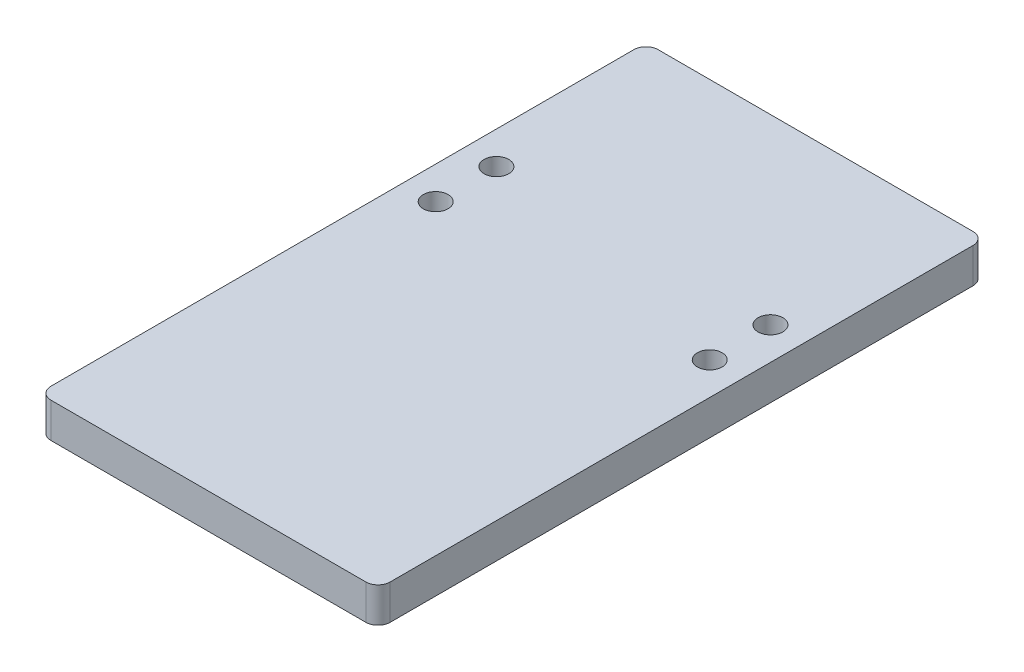
ISO-10303-21;
HEADER;
FILE_DESCRIPTION(('STEP AP214'),'2;1');
FILE_NAME('part.step','',(''),(''),'','','');
FILE_SCHEMA(('AUTOMOTIVE_DESIGN { 1 0 10303 214 1 1 1 1 }'));
ENDSEC;
DATA;
#1=APPLICATION_CONTEXT('core data for automotive mechanical design processes');
#2=APPLICATION_PROTOCOL_DEFINITION('international standard','automotive_design',2000,#1);
#3=PRODUCT_CONTEXT('',#1,'mechanical');
#4=PRODUCT('Part','Part','',(#3));
#5=PRODUCT_RELATED_PRODUCT_CATEGORY('part','',(#4));
#6=PRODUCT_DEFINITION_FORMATION('','',#4);
#7=PRODUCT_DEFINITION_CONTEXT('part definition',#1,'design');
#8=PRODUCT_DEFINITION('design','',#6,#7);
#9=PRODUCT_DEFINITION_SHAPE('','',#8);
#10=(LENGTH_UNIT() NAMED_UNIT(*) SI_UNIT(.MILLI.,.METRE.));
#11=(NAMED_UNIT(*) PLANE_ANGLE_UNIT() SI_UNIT($,.RADIAN.));
#12=(NAMED_UNIT(*) SI_UNIT($,.STERADIAN.) SOLID_ANGLE_UNIT());
#13=UNCERTAINTY_MEASURE_WITH_UNIT(LENGTH_MEASURE(1.E-05),#10,'distance_accuracy_value','');
#14=(GEOMETRIC_REPRESENTATION_CONTEXT(3) GLOBAL_UNCERTAINTY_ASSIGNED_CONTEXT((#13)) GLOBAL_UNIT_ASSIGNED_CONTEXT((#10,
#11,#12)) REPRESENTATION_CONTEXT('',''));
#15=CARTESIAN_POINT('',(0.,0.,0.));
#16=DIRECTION('',(0.,0.,1.));
#17=DIRECTION('',(1.,0.,0.));
#18=AXIS2_PLACEMENT_3D('',#15,#16,#17);
#19=CARTESIAN_POINT('',(-35.472859966,7.3152,63.5));
#20=DIRECTION('',(1.,0.,0.));
#21=DIRECTION('',(0.,0.,-1.));
#22=AXIS2_PLACEMENT_3D('',#19,#20,#21);
#23=PLANE('',#22);
#24=DIRECTION('',(0.,0.,1.));
#25=VECTOR('',#24,1.);
#26=CARTESIAN_POINT('',(-35.472859966,0.,63.5));
#27=LINE('',#26,#25);
#28=CARTESIAN_POINT('',(-35.472859966,0.,-60.96));
#29=VERTEX_POINT('',#28);
#30=CARTESIAN_POINT('',(-35.472859966,0.,60.96));
#31=VERTEX_POINT('',#30);
#32=EDGE_CURVE('E132',#29,#31,#27,.T.);
#33=ORIENTED_EDGE('',*,*,#32,.T.);
#34=DIRECTION('',(0.,-1.,0.));
#35=VECTOR('',#34,1.);
#36=CARTESIAN_POINT('',(-35.472859966,7.3152,60.96));
#37=LINE('',#36,#35);
#38=CARTESIAN_POINT('',(-35.472859966,7.3152,60.96));
#39=VERTEX_POINT('',#38);
#40=EDGE_CURVE('E155',#31,#39,#37,.F.);
#41=ORIENTED_EDGE('',*,*,#40,.T.);
#42=DIRECTION('',(0.,0.,1.));
#43=VECTOR('',#42,1.);
#44=CARTESIAN_POINT('',(-35.472859966,7.3152,63.5));
#45=LINE('',#44,#43);
#46=CARTESIAN_POINT('',(-35.472859966,7.3152,-60.96));
#47=VERTEX_POINT('',#46);
#48=EDGE_CURVE('E130',#47,#39,#45,.T.);
#49=ORIENTED_EDGE('',*,*,#48,.F.);
#50=DIRECTION('',(0.,-1.,0.));
#51=VECTOR('',#50,1.);
#52=CARTESIAN_POINT('',(-35.472859966,7.3152,-60.96));
#53=LINE('',#52,#51);
#54=EDGE_CURVE('E152',#47,#29,#53,.T.);
#55=ORIENTED_EDGE('',*,*,#54,.T.);
#56=EDGE_LOOP('',(#33,#41,#49,#55));
#57=FACE_BOUND('',#56,.T.);
#58=ADVANCED_FACE('F37',(#57),#23,.F.);
#59=CARTESIAN_POINT('',(35.472859966,7.3152,63.5));
#60=DIRECTION('',(0.,0.,-1.));
#61=DIRECTION('',(-1.,0.,0.));
#62=AXIS2_PLACEMENT_3D('',#59,#60,#61);
#63=PLANE('',#62);
#64=DIRECTION('',(1.,0.,0.));
#65=VECTOR('',#64,1.);
#66=CARTESIAN_POINT('',(35.472859966,0.,63.5));
#67=LINE('',#66,#65);
#68=CARTESIAN_POINT('',(-32.932859966,0.,63.5));
#69=VERTEX_POINT('',#68);
#70=CARTESIAN_POINT('',(32.932859966,0.,63.5));
#71=VERTEX_POINT('',#70);
#72=EDGE_CURVE('E128',#69,#71,#67,.T.);
#73=ORIENTED_EDGE('',*,*,#72,.T.);
#74=DIRECTION('',(0.,-1.,0.));
#75=VECTOR('',#74,1.);
#76=CARTESIAN_POINT('',(32.932859966,7.3152,63.5));
#77=LINE('',#76,#75);
#78=CARTESIAN_POINT('',(32.932859966,7.3152,63.5));
#79=VERTEX_POINT('',#78);
#80=EDGE_CURVE('E107',#71,#79,#77,.F.);
#81=ORIENTED_EDGE('',*,*,#80,.T.);
#82=DIRECTION('',(1.,0.,0.));
#83=VECTOR('',#82,1.);
#84=CARTESIAN_POINT('',(35.472859966,7.3152,63.5));
#85=LINE('',#84,#83);
#86=CARTESIAN_POINT('',(-32.932859966,7.3152,63.5));
#87=VERTEX_POINT('',#86);
#88=EDGE_CURVE('E171',#87,#79,#85,.T.);
#89=ORIENTED_EDGE('',*,*,#88,.F.);
#90=DIRECTION('',(0.,-1.,0.));
#91=VECTOR('',#90,1.);
#92=CARTESIAN_POINT('',(-32.932859966,7.3152,63.5));
#93=LINE('',#92,#91);
#94=EDGE_CURVE('E112',#87,#69,#93,.T.);
#95=ORIENTED_EDGE('',*,*,#94,.T.);
#96=EDGE_LOOP('',(#73,#81,#89,#95));
#97=FACE_BOUND('',#96,.T.);
#98=ADVANCED_FACE('F220',(#97),#63,.F.);
#99=CARTESIAN_POINT('',(35.472859966,7.3152,63.5));
#100=DIRECTION('',(-1.,0.,0.));
#101=DIRECTION('',(0.,0.,1.));
#102=AXIS2_PLACEMENT_3D('',#99,#100,#101);
#103=PLANE('',#102);
#104=DIRECTION('',(0.,0.,-1.));
#105=VECTOR('',#104,1.);
#106=CARTESIAN_POINT('',(35.472859966,7.3152,63.5));
#107=LINE('',#106,#105);
#108=CARTESIAN_POINT('',(35.472859966,7.3152,60.96));
#109=VERTEX_POINT('',#108);
#110=CARTESIAN_POINT('',(35.472859966,7.3152,-60.96));
#111=VERTEX_POINT('',#110);
#112=EDGE_CURVE('E121',#109,#111,#107,.T.);
#113=ORIENTED_EDGE('',*,*,#112,.F.);
#114=DIRECTION('',(0.,-1.,0.));
#115=VECTOR('',#114,1.);
#116=CARTESIAN_POINT('',(35.472859966,7.3152,60.96));
#117=LINE('',#116,#115);
#118=CARTESIAN_POINT('',(35.472859966,0.,60.96));
#119=VERTEX_POINT('',#118);
#120=EDGE_CURVE('E106',#109,#119,#117,.T.);
#121=ORIENTED_EDGE('',*,*,#120,.T.);
#122=DIRECTION('',(0.,0.,-1.));
#123=VECTOR('',#122,1.);
#124=CARTESIAN_POINT('',(35.472859966,0.,63.5));
#125=LINE('',#124,#123);
#126=CARTESIAN_POINT('',(35.472859966,0.,-60.96));
#127=VERTEX_POINT('',#126);
#128=EDGE_CURVE('E119',#119,#127,#125,.T.);
#129=ORIENTED_EDGE('',*,*,#128,.T.);
#130=DIRECTION('',(0.,-1.,0.));
#131=VECTOR('',#130,1.);
#132=CARTESIAN_POINT('',(35.472859966,7.3152,-60.96));
#133=LINE('',#132,#131);
#134=EDGE_CURVE('E123',#127,#111,#133,.F.);
#135=ORIENTED_EDGE('',*,*,#134,.T.);
#136=EDGE_LOOP('',(#113,#121,#129,#135));
#137=FACE_BOUND('',#136,.T.);
#138=ADVANCED_FACE('F118',(#137),#103,.F.);
#139=CARTESIAN_POINT('',(35.472859966,7.3152,-63.5));
#140=DIRECTION('',(0.,0.,1.));
#141=DIRECTION('',(1.,0.,0.));
#142=AXIS2_PLACEMENT_3D('',#139,#140,#141);
#143=PLANE('',#142);
#144=DIRECTION('',(-1.,0.,0.));
#145=VECTOR('',#144,1.);
#146=CARTESIAN_POINT('',(35.472859966,0.,-63.5));
#147=LINE('',#146,#145);
#148=CARTESIAN_POINT('',(32.932859966,0.,-63.5));
#149=VERTEX_POINT('',#148);
#150=CARTESIAN_POINT('',(-32.932859966,0.,-63.5));
#151=VERTEX_POINT('',#150);
#152=EDGE_CURVE('E127',#149,#151,#147,.T.);
#153=ORIENTED_EDGE('',*,*,#152,.T.);
#154=DIRECTION('',(0.,-1.,0.));
#155=VECTOR('',#154,1.);
#156=CARTESIAN_POINT('',(-32.932859966,7.3152,-63.5));
#157=LINE('',#156,#155);
#158=CARTESIAN_POINT('',(-32.932859966,7.3152,-63.5));
#159=VERTEX_POINT('',#158);
#160=EDGE_CURVE('E11',#151,#159,#157,.F.);
#161=ORIENTED_EDGE('',*,*,#160,.T.);
#162=DIRECTION('',(-1.,0.,0.));
#163=VECTOR('',#162,1.);
#164=CARTESIAN_POINT('',(35.472859966,7.3152,-63.5));
#165=LINE('',#164,#163);
#166=CARTESIAN_POINT('',(32.932859966,7.3152,-63.5));
#167=VERTEX_POINT('',#166);
#168=EDGE_CURVE('E136',#167,#159,#165,.T.);
#169=ORIENTED_EDGE('',*,*,#168,.F.);
#170=DIRECTION('',(0.,-1.,0.));
#171=VECTOR('',#170,1.);
#172=CARTESIAN_POINT('',(32.932859966,7.3152,-63.5));
#173=LINE('',#172,#171);
#174=EDGE_CURVE('E45',#167,#149,#173,.T.);
#175=ORIENTED_EDGE('',*,*,#174,.T.);
#176=EDGE_LOOP('',(#153,#161,#169,#175));
#177=FACE_BOUND('',#176,.T.);
#178=ADVANCED_FACE('F158',(#177),#143,.F.);
#179=CARTESIAN_POINT('',(0.,7.3152,0.));
#180=DIRECTION('',(0.,1.,0.));
#181=DIRECTION('',(0.,0.,1.));
#182=AXIS2_PLACEMENT_3D('',#179,#180,#181);
#183=PLANE('',#182);
#184=CARTESIAN_POINT('',(28.662459966,7.3152,-12.7));
#185=DIRECTION('',(0.,1.,0.));
#186=DIRECTION('',(0.,0.,1.));
#187=AXIS2_PLACEMENT_3D('',#184,#185,#186);
#188=CIRCLE('',#187,2.59079999999998);
#189=CARTESIAN_POINT('',(28.662459966,7.3152,-10.1092));
#190=VERTEX_POINT('',#189);
#191=EDGE_CURVE('E203',#190,#190,#188,.T.);
#192=ORIENTED_EDGE('',*,*,#191,.F.);
#193=EDGE_LOOP('',(#192));
#194=FACE_BOUND('',#193,.T.);
#195=CARTESIAN_POINT('',(28.662459966,7.3152,-25.4));
#196=DIRECTION('',(0.,1.,0.));
#197=DIRECTION('',(0.,0.,1.));
#198=AXIS2_PLACEMENT_3D('',#195,#196,#197);
#199=CIRCLE('',#198,2.59079999999998);
#200=CARTESIAN_POINT('',(28.662459966,7.3152,-22.8092));
#201=VERTEX_POINT('',#200);
#202=EDGE_CURVE('E197',#201,#201,#199,.T.);
#203=ORIENTED_EDGE('',*,*,#202,.F.);
#204=EDGE_LOOP('',(#203));
#205=FACE_BOUND('',#204,.T.);
#206=CARTESIAN_POINT('',(-28.662459966,7.3152,-12.7));
#207=DIRECTION('',(0.,1.,0.));
#208=DIRECTION('',(0.,0.,1.));
#209=AXIS2_PLACEMENT_3D('',#206,#207,#208);
#210=CIRCLE('',#209,2.59079999999999);
#211=CARTESIAN_POINT('',(-28.662459966,7.3152,-10.1092));
#212=VERTEX_POINT('',#211);
#213=EDGE_CURVE('E189',#212,#212,#210,.T.);
#214=ORIENTED_EDGE('',*,*,#213,.F.);
#215=EDGE_LOOP('',(#214));
#216=FACE_BOUND('',#215,.T.);
#217=CARTESIAN_POINT('',(-28.662459966,7.3152,-25.4));
#218=DIRECTION('',(0.,1.,0.));
#219=DIRECTION('',(0.,0.,1.));
#220=AXIS2_PLACEMENT_3D('',#217,#218,#219);
#221=CIRCLE('',#220,2.59079999999999);
#222=CARTESIAN_POINT('',(-28.662459966,7.3152,-22.8092));
#223=VERTEX_POINT('',#222);
#224=EDGE_CURVE('E181',#223,#223,#221,.T.);
#225=ORIENTED_EDGE('',*,*,#224,.F.);
#226=EDGE_LOOP('',(#225));
#227=FACE_BOUND('',#226,.T.);
#228=ORIENTED_EDGE('',*,*,#88,.T.);
#229=CARTESIAN_POINT('',(32.932859966,7.3152,60.96));
#230=DIRECTION('',(0.,1.,0.));
#231=DIRECTION('',(0.,0.,1.));
#232=AXIS2_PLACEMENT_3D('',#229,#230,#231);
#233=CIRCLE('',#232,2.54);
#234=EDGE_CURVE('E150',#79,#109,#233,.T.);
#235=ORIENTED_EDGE('',*,*,#234,.T.);
#236=ORIENTED_EDGE('',*,*,#112,.T.);
#237=CARTESIAN_POINT('',(32.932859966,7.3152,-60.96));
#238=DIRECTION('',(0.,1.,0.));
#239=DIRECTION('',(0.,0.,1.));
#240=AXIS2_PLACEMENT_3D('',#237,#238,#239);
#241=CIRCLE('',#240,2.54);
#242=EDGE_CURVE('E57',#111,#167,#241,.T.);
#243=ORIENTED_EDGE('',*,*,#242,.T.);
#244=ORIENTED_EDGE('',*,*,#168,.T.);
#245=CARTESIAN_POINT('',(-32.932859966,7.3152,-60.96));
#246=DIRECTION('',(0.,1.,0.));
#247=DIRECTION('',(0.,0.,1.));
#248=AXIS2_PLACEMENT_3D('',#245,#246,#247);
#249=CIRCLE('',#248,2.54);
#250=EDGE_CURVE('E146',#159,#47,#249,.T.);
#251=ORIENTED_EDGE('',*,*,#250,.T.);
#252=ORIENTED_EDGE('',*,*,#48,.T.);
#253=CARTESIAN_POINT('',(-32.932859966,7.3152,60.96));
#254=DIRECTION('',(0.,1.,0.));
#255=DIRECTION('',(0.,0.,1.));
#256=AXIS2_PLACEMENT_3D('',#253,#254,#255);
#257=CIRCLE('',#256,2.54);
#258=EDGE_CURVE('E148',#39,#87,#257,.T.);
#259=ORIENTED_EDGE('',*,*,#258,.T.);
#260=EDGE_LOOP('',(#228,#235,#236,#243,#244,#251,#252,#259));
#261=FACE_BOUND('',#260,.T.);
#262=ADVANCED_FACE('F209',(#194,#205,#216,#227,#261),#183,.T.);
#263=CARTESIAN_POINT('',(0.,0.,0.));
#264=DIRECTION('',(0.,1.,0.));
#265=DIRECTION('',(0.,0.,1.));
#266=AXIS2_PLACEMENT_3D('',#263,#264,#265);
#267=PLANE('',#266);
#268=CARTESIAN_POINT('',(28.662459966,0.,-12.7));
#269=DIRECTION('',(0.,1.,0.));
#270=DIRECTION('',(0.,0.,1.));
#271=AXIS2_PLACEMENT_3D('',#268,#269,#270);
#272=CIRCLE('',#271,2.5908);
#273=CARTESIAN_POINT('',(28.662459966,0.,-10.1092));
#274=VERTEX_POINT('',#273);
#275=EDGE_CURVE('E200',#274,#274,#272,.T.);
#276=ORIENTED_EDGE('',*,*,#275,.T.);
#277=EDGE_LOOP('',(#276));
#278=FACE_BOUND('',#277,.T.);
#279=CARTESIAN_POINT('',(28.662459966,0.,-25.4));
#280=DIRECTION('',(0.,1.,0.));
#281=DIRECTION('',(0.,0.,1.));
#282=AXIS2_PLACEMENT_3D('',#279,#280,#281);
#283=CIRCLE('',#282,2.5908);
#284=CARTESIAN_POINT('',(28.662459966,0.,-22.8092));
#285=VERTEX_POINT('',#284);
#286=EDGE_CURVE('E194',#285,#285,#283,.T.);
#287=ORIENTED_EDGE('',*,*,#286,.T.);
#288=EDGE_LOOP('',(#287));
#289=FACE_BOUND('',#288,.T.);
#290=CARTESIAN_POINT('',(-28.662459966,0.,-12.7));
#291=DIRECTION('',(0.,1.,0.));
#292=DIRECTION('',(0.,0.,1.));
#293=AXIS2_PLACEMENT_3D('',#290,#291,#292);
#294=CIRCLE('',#293,2.5908);
#295=CARTESIAN_POINT('',(-28.662459966,0.,-10.1092));
#296=VERTEX_POINT('',#295);
#297=EDGE_CURVE('E185',#296,#296,#294,.T.);
#298=ORIENTED_EDGE('',*,*,#297,.T.);
#299=EDGE_LOOP('',(#298));
#300=FACE_BOUND('',#299,.T.);
#301=CARTESIAN_POINT('',(-28.662459966,0.,-25.4));
#302=DIRECTION('',(0.,1.,0.));
#303=DIRECTION('',(0.,0.,1.));
#304=AXIS2_PLACEMENT_3D('',#301,#302,#303);
#305=CIRCLE('',#304,2.5908);
#306=CARTESIAN_POINT('',(-28.662459966,0.,-22.8092));
#307=VERTEX_POINT('',#306);
#308=EDGE_CURVE('E176',#307,#307,#305,.T.);
#309=ORIENTED_EDGE('',*,*,#308,.T.);
#310=EDGE_LOOP('',(#309));
#311=FACE_BOUND('',#310,.T.);
#312=ORIENTED_EDGE('',*,*,#128,.F.);
#313=CARTESIAN_POINT('',(32.932859966,0.,60.96));
#314=DIRECTION('',(0.,1.,0.));
#315=DIRECTION('',(0.,0.,1.));
#316=AXIS2_PLACEMENT_3D('',#313,#314,#315);
#317=CIRCLE('',#316,2.54);
#318=EDGE_CURVE('E102',#119,#71,#317,.F.);
#319=ORIENTED_EDGE('',*,*,#318,.T.);
#320=ORIENTED_EDGE('',*,*,#72,.F.);
#321=CARTESIAN_POINT('',(-32.932859966,0.,60.96));
#322=DIRECTION('',(0.,1.,0.));
#323=DIRECTION('',(0.,0.,1.));
#324=AXIS2_PLACEMENT_3D('',#321,#322,#323);
#325=CIRCLE('',#324,2.54);
#326=EDGE_CURVE('E113',#69,#31,#325,.F.);
#327=ORIENTED_EDGE('',*,*,#326,.T.);
#328=ORIENTED_EDGE('',*,*,#32,.F.);
#329=CARTESIAN_POINT('',(-32.932859966,0.,-60.96));
#330=DIRECTION('',(0.,1.,0.));
#331=DIRECTION('',(0.,0.,1.));
#332=AXIS2_PLACEMENT_3D('',#329,#330,#331);
#333=CIRCLE('',#332,2.54);
#334=EDGE_CURVE('E139',#29,#151,#333,.F.);
#335=ORIENTED_EDGE('',*,*,#334,.T.);
#336=ORIENTED_EDGE('',*,*,#152,.F.);
#337=CARTESIAN_POINT('',(32.932859966,0.,-60.96));
#338=DIRECTION('',(0.,1.,0.));
#339=DIRECTION('',(0.,0.,1.));
#340=AXIS2_PLACEMENT_3D('',#337,#338,#339);
#341=CIRCLE('',#340,2.54);
#342=EDGE_CURVE('E122',#149,#127,#341,.F.);
#343=ORIENTED_EDGE('',*,*,#342,.T.);
#344=EDGE_LOOP('',(#312,#319,#320,#327,#328,#335,#336,#343));
#345=FACE_BOUND('',#344,.T.);
#346=ADVANCED_FACE('F125',(#278,#289,#300,#311,#345),#267,.F.);
#347=CARTESIAN_POINT('',(-28.662459966,7.3152,-25.4));
#348=DIRECTION('',(0.,1.,0.));
#349=DIRECTION('',(0.,0.,1.));
#350=AXIS2_PLACEMENT_3D('',#347,#348,#349);
#351=CYLINDRICAL_SURFACE('',#350,2.59079999999999);
#352=ORIENTED_EDGE('',*,*,#308,.F.);
#353=EDGE_LOOP('',(#352));
#354=FACE_BOUND('',#353,.T.);
#355=ORIENTED_EDGE('',*,*,#224,.T.);
#356=EDGE_LOOP('',(#355));
#357=FACE_BOUND('',#356,.T.);
#358=ADVANCED_FACE('F242',(#354,#357),#351,.F.);
#359=CARTESIAN_POINT('',(-28.662459966,7.3152,-12.7));
#360=DIRECTION('',(0.,1.,0.));
#361=DIRECTION('',(0.,0.,1.));
#362=AXIS2_PLACEMENT_3D('',#359,#360,#361);
#363=CYLINDRICAL_SURFACE('',#362,2.59079999999999);
#364=ORIENTED_EDGE('',*,*,#297,.F.);
#365=EDGE_LOOP('',(#364));
#366=FACE_BOUND('',#365,.T.);
#367=ORIENTED_EDGE('',*,*,#213,.T.);
#368=EDGE_LOOP('',(#367));
#369=FACE_BOUND('',#368,.T.);
#370=ADVANCED_FACE('F247',(#366,#369),#363,.F.);
#371=CARTESIAN_POINT('',(28.662459966,7.3152,-25.4));
#372=DIRECTION('',(0.,1.,0.));
#373=DIRECTION('',(0.,0.,1.));
#374=AXIS2_PLACEMENT_3D('',#371,#372,#373);
#375=CYLINDRICAL_SURFACE('',#374,2.59079999999999);
#376=ORIENTED_EDGE('',*,*,#286,.F.);
#377=EDGE_LOOP('',(#376));
#378=FACE_BOUND('',#377,.T.);
#379=ORIENTED_EDGE('',*,*,#202,.T.);
#380=EDGE_LOOP('',(#379));
#381=FACE_BOUND('',#380,.T.);
#382=ADVANCED_FACE('F251',(#378,#381),#375,.F.);
#383=CARTESIAN_POINT('',(28.662459966,7.3152,-12.7));
#384=DIRECTION('',(0.,1.,0.));
#385=DIRECTION('',(0.,0.,1.));
#386=AXIS2_PLACEMENT_3D('',#383,#384,#385);
#387=CYLINDRICAL_SURFACE('',#386,2.59079999999999);
#388=ORIENTED_EDGE('',*,*,#275,.F.);
#389=EDGE_LOOP('',(#388));
#390=FACE_BOUND('',#389,.T.);
#391=ORIENTED_EDGE('',*,*,#191,.T.);
#392=EDGE_LOOP('',(#391));
#393=FACE_BOUND('',#392,.T.);
#394=ADVANCED_FACE('F207',(#390,#393),#387,.F.);
#395=CARTESIAN_POINT('',(32.932859966,7.3152,60.96));
#396=DIRECTION('',(0.,-1.,0.));
#397=DIRECTION('',(0.,0.,-1.));
#398=AXIS2_PLACEMENT_3D('',#395,#396,#397);
#399=CYLINDRICAL_SURFACE('',#398,2.54);
#400=ORIENTED_EDGE('',*,*,#234,.F.);
#401=ORIENTED_EDGE('',*,*,#80,.F.);
#402=ORIENTED_EDGE('',*,*,#318,.F.);
#403=ORIENTED_EDGE('',*,*,#120,.F.);
#404=EDGE_LOOP('',(#400,#401,#402,#403));
#405=FACE_BOUND('',#404,.T.);
#406=ADVANCED_FACE('F105',(#405),#399,.T.);
#407=CARTESIAN_POINT('',(-32.932859966,7.3152,60.96));
#408=DIRECTION('',(0.,-1.,0.));
#409=DIRECTION('',(0.,0.,-1.));
#410=AXIS2_PLACEMENT_3D('',#407,#408,#409);
#411=CYLINDRICAL_SURFACE('',#410,2.54);
#412=ORIENTED_EDGE('',*,*,#258,.F.);
#413=ORIENTED_EDGE('',*,*,#40,.F.);
#414=ORIENTED_EDGE('',*,*,#326,.F.);
#415=ORIENTED_EDGE('',*,*,#94,.F.);
#416=EDGE_LOOP('',(#412,#413,#414,#415));
#417=FACE_BOUND('',#416,.T.);
#418=ADVANCED_FACE('F222',(#417),#411,.T.);
#419=CARTESIAN_POINT('',(-32.932859966,7.3152,-60.96));
#420=DIRECTION('',(0.,-1.,0.));
#421=DIRECTION('',(0.,0.,-1.));
#422=AXIS2_PLACEMENT_3D('',#419,#420,#421);
#423=CYLINDRICAL_SURFACE('',#422,2.54);
#424=ORIENTED_EDGE('',*,*,#250,.F.);
#425=ORIENTED_EDGE('',*,*,#160,.F.);
#426=ORIENTED_EDGE('',*,*,#334,.F.);
#427=ORIENTED_EDGE('',*,*,#54,.F.);
#428=EDGE_LOOP('',(#424,#425,#426,#427));
#429=FACE_BOUND('',#428,.T.);
#430=ADVANCED_FACE('F165',(#429),#423,.T.);
#431=CARTESIAN_POINT('',(32.932859966,7.3152,-60.96));
#432=DIRECTION('',(0.,-1.,0.));
#433=DIRECTION('',(0.,0.,-1.));
#434=AXIS2_PLACEMENT_3D('',#431,#432,#433);
#435=CYLINDRICAL_SURFACE('',#434,2.54);
#436=ORIENTED_EDGE('',*,*,#242,.F.);
#437=ORIENTED_EDGE('',*,*,#134,.F.);
#438=ORIENTED_EDGE('',*,*,#342,.F.);
#439=ORIENTED_EDGE('',*,*,#174,.F.);
#440=EDGE_LOOP('',(#436,#437,#438,#439));
#441=FACE_BOUND('',#440,.T.);
#442=ADVANCED_FACE('F39',(#441),#435,.T.);
#443=CLOSED_SHELL('',(#58,#98,#138,#178,#262,#346,#358,#370,#382,#394,#406,#418,#430,#442));
#444=MANIFOLD_SOLID_BREP('B2',#443);
#445=ADVANCED_BREP_SHAPE_REPRESENTATION('',(#18,#444),#14);
#446=SHAPE_DEFINITION_REPRESENTATION(#9,#445);
ENDSEC;
END-ISO-10303-21;
